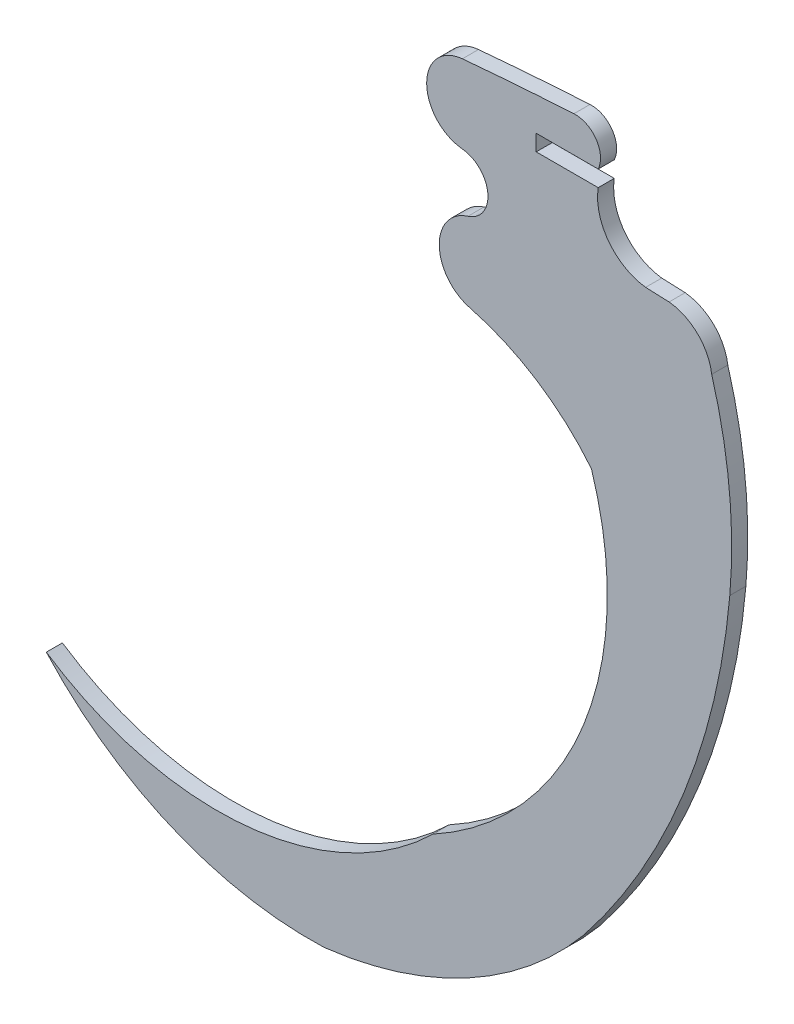
ISO-10303-21;
HEADER;
FILE_DESCRIPTION(('STEP AP214'),'2;1');
FILE_NAME('part.step','',(''),(''),'','','');
FILE_SCHEMA(('AUTOMOTIVE_DESIGN { 1 0 10303 214 1 1 1 1 }'));
ENDSEC;
DATA;
#1=APPLICATION_CONTEXT('core data for automotive mechanical design processes');
#2=APPLICATION_PROTOCOL_DEFINITION('international standard','automotive_design',2000,#1);
#3=PRODUCT_CONTEXT('',#1,'mechanical');
#4=PRODUCT('Part','Part','',(#3));
#5=PRODUCT_RELATED_PRODUCT_CATEGORY('part','',(#4));
#6=PRODUCT_DEFINITION_FORMATION('','',#4);
#7=PRODUCT_DEFINITION_CONTEXT('part definition',#1,'design');
#8=PRODUCT_DEFINITION('design','',#6,#7);
#9=PRODUCT_DEFINITION_SHAPE('','',#8);
#10=(LENGTH_UNIT() NAMED_UNIT(*) SI_UNIT(.MILLI.,.METRE.));
#11=(NAMED_UNIT(*) PLANE_ANGLE_UNIT() SI_UNIT($,.RADIAN.));
#12=(NAMED_UNIT(*) SI_UNIT($,.STERADIAN.) SOLID_ANGLE_UNIT());
#13=UNCERTAINTY_MEASURE_WITH_UNIT(LENGTH_MEASURE(1.E-05),#10,'distance_accuracy_value','');
#14=(GEOMETRIC_REPRESENTATION_CONTEXT(3) GLOBAL_UNCERTAINTY_ASSIGNED_CONTEXT((#13)) GLOBAL_UNIT_ASSIGNED_CONTEXT((#10,
#11,#12)) REPRESENTATION_CONTEXT('',''));
#15=CARTESIAN_POINT('',(0.,0.,0.));
#16=DIRECTION('',(0.,0.,1.));
#17=DIRECTION('',(1.,0.,0.));
#18=AXIS2_PLACEMENT_3D('',#15,#16,#17);
#19=CARTESIAN_POINT('',(-0.784942262282554,20.4143601388889,1.524));
#20=DIRECTION('',(0.,0.,-1.));
#21=DIRECTION('',(-1.,0.,0.));
#22=AXIS2_PLACEMENT_3D('',#19,#20,#21);
#23=CYLINDRICAL_SURFACE('',#22,2.38784541425426);
#24=CARTESIAN_POINT('',(-0.784942262282554,20.4143601388889,0.));
#25=DIRECTION('',(0.,0.,1.));
#26=DIRECTION('',(1.,0.,0.));
#27=AXIS2_PLACEMENT_3D('',#24,#25,#26);
#28=CIRCLE('',#27,2.38784541425426);
#29=CARTESIAN_POINT('',(1.38088964129089,19.4088861770985,0.));
#30=VERTEX_POINT('',#29);
#31=CARTESIAN_POINT('',(-0.921759528206126,22.7982826959617,0.));
#32=VERTEX_POINT('',#31);
#33=EDGE_CURVE('E191',#30,#32,#28,.T.);
#34=ORIENTED_EDGE('',*,*,#33,.T.);
#35=DIRECTION('',(0.,0.,-1.));
#36=VECTOR('',#35,1.);
#37=CARTESIAN_POINT('',(-0.921759528206126,22.7982826959617,1.524));
#38=LINE('',#37,#36);
#39=CARTESIAN_POINT('',(-0.921759528206126,22.7982826959617,1.524));
#40=VERTEX_POINT('',#39);
#41=EDGE_CURVE('E11',#40,#32,#38,.T.);
#42=ORIENTED_EDGE('',*,*,#41,.F.);
#43=CARTESIAN_POINT('',(-0.784942262282554,20.4143601388889,1.524));
#44=DIRECTION('',(0.,0.,1.));
#45=DIRECTION('',(1.,0.,0.));
#46=AXIS2_PLACEMENT_3D('',#43,#44,#45);
#47=CIRCLE('',#46,2.38784541425426);
#48=CARTESIAN_POINT('',(1.38088964129089,19.4088861770985,1.524));
#49=VERTEX_POINT('',#48);
#50=EDGE_CURVE('E225',#49,#40,#47,.T.);
#51=ORIENTED_EDGE('',*,*,#50,.F.);
#52=DIRECTION('',(0.,0.,-1.));
#53=VECTOR('',#52,1.);
#54=CARTESIAN_POINT('',(1.38088964129089,19.4088861770985,1.524));
#55=LINE('',#54,#53);
#56=EDGE_CURVE('E187',#49,#30,#55,.T.);
#57=ORIENTED_EDGE('',*,*,#56,.T.);
#58=EDGE_LOOP('',(#34,#42,#51,#57));
#59=FACE_BOUND('',#58,.T.);
#60=ADVANCED_FACE('F35',(#59),#23,.T.);
#61=CARTESIAN_POINT('',(18.5640747840189,-314.932998519077,1.524));
#62=DIRECTION('',(0.,0.,-1.));
#63=DIRECTION('',(-1.,0.,0.));
#64=AXIS2_PLACEMENT_3D('',#61,#62,#63);
#65=CYLINDRICAL_SURFACE('',#64,338.292944132737);
#66=CARTESIAN_POINT('',(18.5640747840189,-314.932998519077,0.));
#67=DIRECTION('',(0.,0.,1.));
#68=DIRECTION('',(1.,0.,0.));
#69=AXIS2_PLACEMENT_3D('',#66,#67,#68);
#70=CIRCLE('',#69,338.292944132737);
#71=CARTESIAN_POINT('',(-11.4899367335429,22.0222988746534,0.));
#72=VERTEX_POINT('',#71);
#73=EDGE_CURVE('E194',#32,#72,#70,.T.);
#74=ORIENTED_EDGE('',*,*,#73,.T.);
#75=DIRECTION('',(0.,0.,-1.));
#76=VECTOR('',#75,1.);
#77=CARTESIAN_POINT('',(-11.4899367335429,22.0222988746534,1.524));
#78=LINE('',#77,#76);
#79=CARTESIAN_POINT('',(-11.4899367335429,22.0222988746534,1.524));
#80=VERTEX_POINT('',#79);
#81=EDGE_CURVE('E43',#80,#72,#78,.T.);
#82=ORIENTED_EDGE('',*,*,#81,.F.);
#83=CARTESIAN_POINT('',(18.5640747840189,-314.932998519077,1.524));
#84=DIRECTION('',(0.,0.,1.));
#85=DIRECTION('',(1.,0.,0.));
#86=AXIS2_PLACEMENT_3D('',#83,#84,#85);
#87=CIRCLE('',#86,338.292944132737);
#88=EDGE_CURVE('E124',#40,#80,#87,.T.);
#89=ORIENTED_EDGE('',*,*,#88,.F.);
#90=ORIENTED_EDGE('',*,*,#41,.T.);
#91=EDGE_LOOP('',(#74,#82,#89,#90));
#92=FACE_BOUND('',#91,.T.);
#93=ADVANCED_FACE('F333',(#92),#65,.T.);
#94=CARTESIAN_POINT('',(-11.1607671554741,18.3214709585125,1.524));
#95=DIRECTION('',(0.,0.,-1.));
#96=DIRECTION('',(-1.,0.,0.));
#97=AXIS2_PLACEMENT_3D('',#94,#95,#96);
#98=CYLINDRICAL_SURFACE('',#97,3.71543804631613);
#99=CARTESIAN_POINT('',(-11.1607671554741,18.3214709585125,0.));
#100=DIRECTION('',(0.,0.,1.));
#101=DIRECTION('',(1.,0.,0.));
#102=AXIS2_PLACEMENT_3D('',#99,#100,#101);
#103=CIRCLE('',#102,3.71543804631613);
#104=CARTESIAN_POINT('',(-11.509843158306,14.6224676035181,0.));
#105=VERTEX_POINT('',#104);
#106=EDGE_CURVE('E196',#72,#105,#103,.T.);
#107=ORIENTED_EDGE('',*,*,#106,.T.);
#108=DIRECTION('',(0.,0.,-1.));
#109=VECTOR('',#108,1.);
#110=CARTESIAN_POINT('',(-11.509843158306,14.6224676035181,1.524));
#111=LINE('',#110,#109);
#112=CARTESIAN_POINT('',(-11.509843158306,14.6224676035181,1.524));
#113=VERTEX_POINT('',#112);
#114=EDGE_CURVE('E262',#113,#105,#111,.T.);
#115=ORIENTED_EDGE('',*,*,#114,.F.);
#116=CARTESIAN_POINT('',(-11.1607671554741,18.3214709585125,1.524));
#117=DIRECTION('',(0.,0.,1.));
#118=DIRECTION('',(1.,0.,0.));
#119=AXIS2_PLACEMENT_3D('',#116,#117,#118);
#120=CIRCLE('',#119,3.71543804631613);
#121=EDGE_CURVE('E270',#80,#113,#120,.T.);
#122=ORIENTED_EDGE('',*,*,#121,.F.);
#123=ORIENTED_EDGE('',*,*,#81,.T.);
#124=EDGE_LOOP('',(#107,#115,#122,#123));
#125=FACE_BOUND('',#124,.T.);
#126=ADVANCED_FACE('F268',(#125),#98,.T.);
#127=CARTESIAN_POINT('',(-11.7628111813776,11.9378924676735,1.524));
#128=DIRECTION('',(0.,0.,-1.));
#129=DIRECTION('',(-1.,0.,0.));
#130=AXIS2_PLACEMENT_3D('',#127,#128,#129);
#131=CYLINDRICAL_SURFACE('',#130,2.69646740768211);
#132=CARTESIAN_POINT('',(-11.7628111813776,11.9378924676735,0.));
#133=DIRECTION('',(0.,0.,-1.));
#134=DIRECTION('',(1.,0.,0.));
#135=AXIS2_PLACEMENT_3D('',#132,#133,#134);
#136=CIRCLE('',#135,2.69646740768211);
#137=CARTESIAN_POINT('',(-10.9654335967297,9.36201873858796,0.));
#138=VERTEX_POINT('',#137);
#139=EDGE_CURVE('E198',#105,#138,#136,.T.);
#140=ORIENTED_EDGE('',*,*,#139,.T.);
#141=DIRECTION('',(0.,0.,-1.));
#142=VECTOR('',#141,1.);
#143=CARTESIAN_POINT('',(-10.9654335967297,9.36201873858796,1.524));
#144=LINE('',#143,#142);
#145=CARTESIAN_POINT('',(-10.9654335967297,9.36201873858796,1.524));
#146=VERTEX_POINT('',#145);
#147=EDGE_CURVE('E259',#146,#138,#144,.T.);
#148=ORIENTED_EDGE('',*,*,#147,.F.);
#149=CARTESIAN_POINT('',(-11.7628111813776,11.9378924676735,1.524));
#150=DIRECTION('',(0.,0.,-1.));
#151=DIRECTION('',(1.,0.,0.));
#152=AXIS2_PLACEMENT_3D('',#149,#150,#151);
#153=CIRCLE('',#152,2.69646740768211);
#154=EDGE_CURVE('E288',#113,#146,#153,.T.);
#155=ORIENTED_EDGE('',*,*,#154,.F.);
#156=ORIENTED_EDGE('',*,*,#114,.T.);
#157=EDGE_LOOP('',(#140,#148,#155,#156));
#158=FACE_BOUND('',#157,.T.);
#159=ADVANCED_FACE('F279',(#158),#131,.F.);
#160=CARTESIAN_POINT('',(-9.82749523112933,5.67780196556632,1.524));
#161=DIRECTION('',(0.,0.,-1.));
#162=DIRECTION('',(-1.,0.,0.));
#163=AXIS2_PLACEMENT_3D('',#160,#161,#162);
#164=CYLINDRICAL_SURFACE('',#163,3.85595084959847);
#165=CARTESIAN_POINT('',(-9.82749523112933,5.67780196556632,0.));
#166=DIRECTION('',(0.,0.,1.));
#167=DIRECTION('',(1.,0.,0.));
#168=AXIS2_PLACEMENT_3D('',#165,#166,#167);
#169=CIRCLE('',#168,3.85595084959847);
#170=CARTESIAN_POINT('',(-10.8028774320945,1.94725421536135,0.));
#171=VERTEX_POINT('',#170);
#172=EDGE_CURVE('E200',#138,#171,#169,.T.);
#173=ORIENTED_EDGE('',*,*,#172,.T.);
#174=DIRECTION('',(0.,0.,-1.));
#175=VECTOR('',#174,1.);
#176=CARTESIAN_POINT('',(-10.8028774320945,1.94725421536135,1.524));
#177=LINE('',#176,#175);
#178=CARTESIAN_POINT('',(-10.8028774320945,1.94725421536135,1.524));
#179=VERTEX_POINT('',#178);
#180=EDGE_CURVE('E256',#179,#171,#177,.T.);
#181=ORIENTED_EDGE('',*,*,#180,.F.);
#182=CARTESIAN_POINT('',(-9.82749523112933,5.67780196556632,1.524));
#183=DIRECTION('',(0.,0.,1.));
#184=DIRECTION('',(1.,0.,0.));
#185=AXIS2_PLACEMENT_3D('',#182,#183,#184);
#186=CIRCLE('',#185,3.85595084959847);
#187=EDGE_CURVE('E285',#146,#179,#186,.T.);
#188=ORIENTED_EDGE('',*,*,#187,.F.);
#189=ORIENTED_EDGE('',*,*,#147,.T.);
#190=EDGE_LOOP('',(#173,#181,#188,#189));
#191=FACE_BOUND('',#190,.T.);
#192=ADVANCED_FACE('F283',(#191),#164,.T.);
#193=CARTESIAN_POINT('',(-16.3588591186506,-19.3155984191151,1.524));
#194=DIRECTION('',(0.,0.,-1.));
#195=DIRECTION('',(-1.,0.,0.));
#196=AXIS2_PLACEMENT_3D('',#193,#194,#195);
#197=CYLINDRICAL_SURFACE('',#196,21.9767566910318);
#198=CARTESIAN_POINT('',(-16.3588591186506,-19.3155984191151,0.));
#199=DIRECTION('',(0.,0.,-1.));
#200=DIRECTION('',(1.,0.,0.));
#201=AXIS2_PLACEMENT_3D('',#198,#199,#200);
#202=CIRCLE('',#201,21.9767566910318);
#203=CARTESIAN_POINT('',(0.739102642079919,-5.50844308988796,0.));
#204=VERTEX_POINT('',#203);
#205=EDGE_CURVE('E202',#171,#204,#202,.T.);
#206=ORIENTED_EDGE('',*,*,#205,.T.);
#207=DIRECTION('',(0.,0.,-1.));
#208=VECTOR('',#207,1.);
#209=CARTESIAN_POINT('',(0.739102642079919,-5.50844308988796,1.524));
#210=LINE('',#209,#208);
#211=CARTESIAN_POINT('',(0.739102642079919,-5.50844308988796,1.524));
#212=VERTEX_POINT('',#211);
#213=EDGE_CURVE('E253',#212,#204,#210,.T.);
#214=ORIENTED_EDGE('',*,*,#213,.F.);
#215=CARTESIAN_POINT('',(-16.3588591186506,-19.3155984191151,1.524));
#216=DIRECTION('',(0.,0.,-1.));
#217=DIRECTION('',(1.,0.,0.));
#218=AXIS2_PLACEMENT_3D('',#215,#216,#217);
#219=CIRCLE('',#218,21.9767566910318);
#220=EDGE_CURVE('E287',#179,#212,#219,.T.);
#221=ORIENTED_EDGE('',*,*,#220,.F.);
#222=ORIENTED_EDGE('',*,*,#180,.T.);
#223=EDGE_LOOP('',(#206,#214,#221,#222));
#224=FACE_BOUND('',#223,.T.);
#225=ADVANCED_FACE('F346',(#224),#197,.F.);
#226=CARTESIAN_POINT('',(-29.4589149965822,-15.170052695649,1.524));
#227=DIRECTION('',(0.,0.,-1.));
#228=DIRECTION('',(-1.,0.,0.));
#229=AXIS2_PLACEMENT_3D('',#226,#227,#228);
#230=CYLINDRICAL_SURFACE('',#229,31.7059453333138);
#231=CARTESIAN_POINT('',(-29.4589149965822,-15.170052695649,0.));
#232=DIRECTION('',(0.,0.,-1.));
#233=DIRECTION('',(-1.,0.,0.));
#234=AXIS2_PLACEMENT_3D('',#231,#232,#233);
#235=CIRCLE('',#234,31.7059453333138);
#236=CARTESIAN_POINT('',(-14.2759432398881,-43.0042823080257,0.));
#237=VERTEX_POINT('',#236);
#238=EDGE_CURVE('E204',#204,#237,#235,.T.);
#239=ORIENTED_EDGE('',*,*,#238,.T.);
#240=DIRECTION('',(0.,0.,-1.));
#241=VECTOR('',#240,1.);
#242=CARTESIAN_POINT('',(-14.2759432398881,-43.0042823080257,1.524));
#243=LINE('',#242,#241);
#244=CARTESIAN_POINT('',(-14.2759432398881,-43.0042823080257,1.524));
#245=VERTEX_POINT('',#244);
#246=EDGE_CURVE('E250',#245,#237,#243,.T.);
#247=ORIENTED_EDGE('',*,*,#246,.F.);
#248=CARTESIAN_POINT('',(-29.4589149965822,-15.170052695649,1.524));
#249=DIRECTION('',(0.,0.,-1.));
#250=DIRECTION('',(-1.,0.,0.));
#251=AXIS2_PLACEMENT_3D('',#248,#249,#250);
#252=CIRCLE('',#251,31.7059453333138);
#253=EDGE_CURVE('E290',#212,#245,#252,.T.);
#254=ORIENTED_EDGE('',*,*,#253,.F.);
#255=ORIENTED_EDGE('',*,*,#213,.T.);
#256=EDGE_LOOP('',(#239,#247,#254,#255));
#257=FACE_BOUND('',#256,.T.);
#258=ADVANCED_FACE('F349',(#257),#230,.F.);
#259=CARTESIAN_POINT('',(-34.6891920562281,-22.0821229812131,1.524));
#260=DIRECTION('',(0.,0.,-1.));
#261=DIRECTION('',(-1.,0.,0.));
#262=AXIS2_PLACEMENT_3D('',#259,#260,#261);
#263=CYLINDRICAL_SURFACE('',#262,29.2307625308396);
#264=CARTESIAN_POINT('',(-34.6891920562281,-22.0821229812131,0.));
#265=DIRECTION('',(0.,0.,-1.));
#266=DIRECTION('',(-1.,0.,0.));
#267=AXIS2_PLACEMENT_3D('',#264,#265,#266);
#268=CIRCLE('',#267,29.2307625308396);
#269=CARTESIAN_POINT('',(-50.921597014821,-46.3915143227212,0.));
#270=VERTEX_POINT('',#269);
#271=EDGE_CURVE('E206',#237,#270,#268,.T.);
#272=ORIENTED_EDGE('',*,*,#271,.T.);
#273=DIRECTION('',(0.,0.,-1.));
#274=VECTOR('',#273,1.);
#275=CARTESIAN_POINT('',(-50.921597014821,-46.3915143227212,1.524));
#276=LINE('',#275,#274);
#277=CARTESIAN_POINT('',(-50.921597014821,-46.3915143227212,1.524));
#278=VERTEX_POINT('',#277);
#279=EDGE_CURVE('E247',#278,#270,#276,.T.);
#280=ORIENTED_EDGE('',*,*,#279,.F.);
#281=CARTESIAN_POINT('',(-34.6891920562281,-22.0821229812131,1.524));
#282=DIRECTION('',(0.,0.,-1.));
#283=DIRECTION('',(-1.,0.,0.));
#284=AXIS2_PLACEMENT_3D('',#281,#282,#283);
#285=CIRCLE('',#284,29.2307625308396);
#286=EDGE_CURVE('E296',#245,#278,#285,.T.);
#287=ORIENTED_EDGE('',*,*,#286,.F.);
#288=ORIENTED_EDGE('',*,*,#246,.T.);
#289=EDGE_LOOP('',(#272,#280,#287,#288));
#290=FACE_BOUND('',#289,.T.);
#291=ADVANCED_FACE('F353',(#290),#263,.F.);
#292=CARTESIAN_POINT('',(-25.8780555890622,-23.6686254452325,1.524));
#293=DIRECTION('',(0.,0.,-1.));
#294=DIRECTION('',(-1.,0.,0.));
#295=AXIS2_PLACEMENT_3D('',#292,#293,#294);
#296=CYLINDRICAL_SURFACE('',#295,33.815804678913);
#297=CARTESIAN_POINT('',(-25.8780555890622,-23.6686254452325,0.));
#298=DIRECTION('',(0.,0.,1.));
#299=DIRECTION('',(1.,0.,0.));
#300=AXIS2_PLACEMENT_3D('',#297,#298,#299);
#301=CIRCLE('',#300,33.815804678913);
#302=CARTESIAN_POINT('',(-24.5856059006903,-57.4597221999314,0.));
#303=VERTEX_POINT('',#302);
#304=EDGE_CURVE('E208',#270,#303,#301,.T.);
#305=ORIENTED_EDGE('',*,*,#304,.T.);
#306=DIRECTION('',(0.,0.,-1.));
#307=VECTOR('',#306,1.);
#308=CARTESIAN_POINT('',(-24.5856059006903,-57.4597221999314,1.524));
#309=LINE('',#308,#307);
#310=CARTESIAN_POINT('',(-24.5856059006903,-57.4597221999314,1.524));
#311=VERTEX_POINT('',#310);
#312=EDGE_CURVE('E244',#311,#303,#309,.T.);
#313=ORIENTED_EDGE('',*,*,#312,.F.);
#314=CARTESIAN_POINT('',(-25.8780555890622,-23.6686254452325,1.524));
#315=DIRECTION('',(0.,0.,1.));
#316=DIRECTION('',(1.,0.,0.));
#317=AXIS2_PLACEMENT_3D('',#314,#315,#316);
#318=CIRCLE('',#317,33.815804678913);
#319=EDGE_CURVE('E298',#278,#311,#318,.T.);
#320=ORIENTED_EDGE('',*,*,#319,.F.);
#321=ORIENTED_EDGE('',*,*,#279,.T.);
#322=EDGE_LOOP('',(#305,#313,#320,#321));
#323=FACE_BOUND('',#322,.T.);
#324=ADVANCED_FACE('F357',(#323),#296,.T.);
#325=CARTESIAN_POINT('',(-28.904056613606,-20.1084777779075,1.524));
#326=DIRECTION('',(0.,0.,-1.));
#327=DIRECTION('',(-1.,0.,0.));
#328=AXIS2_PLACEMENT_3D('',#325,#326,#327);
#329=CYLINDRICAL_SURFACE('',#328,37.6000595269961);
#330=CARTESIAN_POINT('',(-28.904056613606,-20.1084777779075,0.));
#331=DIRECTION('',(0.,0.,1.));
#332=DIRECTION('',(1.,0.,0.));
#333=AXIS2_PLACEMENT_3D('',#330,#331,#332);
#334=CIRCLE('',#333,37.6000595269961);
#335=CARTESIAN_POINT('',(0.,-44.1567622845227,0.));
#336=VERTEX_POINT('',#335);
#337=EDGE_CURVE('E210',#303,#336,#334,.T.);
#338=ORIENTED_EDGE('',*,*,#337,.T.);
#339=DIRECTION('',(0.,0.,-1.));
#340=VECTOR('',#339,1.);
#341=CARTESIAN_POINT('',(0.,-44.1567622845227,1.524));
#342=LINE('',#341,#340);
#343=CARTESIAN_POINT('',(0.,-44.1567622845227,1.524));
#344=VERTEX_POINT('',#343);
#345=EDGE_CURVE('E241',#344,#336,#342,.T.);
#346=ORIENTED_EDGE('',*,*,#345,.F.);
#347=CARTESIAN_POINT('',(-28.904056613606,-20.1084777779075,1.524));
#348=DIRECTION('',(0.,0.,1.));
#349=DIRECTION('',(1.,0.,0.));
#350=AXIS2_PLACEMENT_3D('',#347,#348,#349);
#351=CIRCLE('',#350,37.6000595269961);
#352=EDGE_CURVE('E300',#311,#344,#351,.T.);
#353=ORIENTED_EDGE('',*,*,#352,.F.);
#354=ORIENTED_EDGE('',*,*,#312,.T.);
#355=EDGE_LOOP('',(#338,#346,#353,#354));
#356=FACE_BOUND('',#355,.T.);
#357=ADVANCED_FACE('F361',(#356),#329,.T.);
#358=CARTESIAN_POINT('',(-51.0452631563205,-3.67881608137278,1.524));
#359=DIRECTION('',(0.,0.,-1.));
#360=DIRECTION('',(-1.,0.,0.));
#361=AXIS2_PLACEMENT_3D('',#358,#359,#360);
#362=CYLINDRICAL_SURFACE('',#361,65.1466270771028);
#363=CARTESIAN_POINT('',(-51.0452631563205,-3.67881608137278,0.));
#364=DIRECTION('',(0.,0.,1.));
#365=DIRECTION('',(-1.,0.,0.));
#366=AXIS2_PLACEMENT_3D('',#363,#364,#365);
#367=CIRCLE('',#366,65.1466270771028);
#368=CARTESIAN_POINT('',(13.8535936008203,-9.35520676024911,0.));
#369=VERTEX_POINT('',#368);
#370=EDGE_CURVE('E212',#336,#369,#367,.T.);
#371=ORIENTED_EDGE('',*,*,#370,.T.);
#372=DIRECTION('',(0.,0.,-1.));
#373=VECTOR('',#372,1.);
#374=CARTESIAN_POINT('',(13.8535936008203,-9.35520676024911,1.524));
#375=LINE('',#374,#373);
#376=CARTESIAN_POINT('',(13.8535936008203,-9.35520676024911,1.524));
#377=VERTEX_POINT('',#376);
#378=EDGE_CURVE('E238',#377,#369,#375,.T.);
#379=ORIENTED_EDGE('',*,*,#378,.F.);
#380=CARTESIAN_POINT('',(-51.0452631563205,-3.67881608137278,1.524));
#381=DIRECTION('',(0.,0.,1.));
#382=DIRECTION('',(-1.,0.,0.));
#383=AXIS2_PLACEMENT_3D('',#380,#381,#382);
#384=CIRCLE('',#383,65.1466270771028);
#385=EDGE_CURVE('E302',#344,#377,#384,.T.);
#386=ORIENTED_EDGE('',*,*,#385,.F.);
#387=ORIENTED_EDGE('',*,*,#345,.T.);
#388=EDGE_LOOP('',(#371,#379,#386,#387));
#389=FACE_BOUND('',#388,.T.);
#390=ADVANCED_FACE('F365',(#389),#362,.T.);
#391=CARTESIAN_POINT('',(-32.9399116034648,-5.26240405083409,1.524));
#392=DIRECTION('',(0.,0.,-1.));
#393=DIRECTION('',(-1.,0.,0.));
#394=AXIS2_PLACEMENT_3D('',#391,#392,#393);
#395=CYLINDRICAL_SURFACE('',#394,46.9721530624439);
#396=CARTESIAN_POINT('',(-32.9399116034648,-5.26240405083409,0.));
#397=DIRECTION('',(0.,0.,1.));
#398=DIRECTION('',(1.,0.,0.));
#399=AXIS2_PLACEMENT_3D('',#396,#397,#398);
#400=CIRCLE('',#399,46.9721530624439);
#401=CARTESIAN_POINT('',(12.1391201751654,7.93850717615695,0.));
#402=VERTEX_POINT('',#401);
#403=EDGE_CURVE('E214',#369,#402,#400,.T.);
#404=ORIENTED_EDGE('',*,*,#403,.T.);
#405=DIRECTION('',(0.,0.,-1.));
#406=VECTOR('',#405,1.);
#407=CARTESIAN_POINT('',(12.1391201751654,7.93850717615695,1.524));
#408=LINE('',#407,#406);
#409=CARTESIAN_POINT('',(12.1391201751654,7.93850717615695,1.524));
#410=VERTEX_POINT('',#409);
#411=EDGE_CURVE('E235',#410,#402,#408,.T.);
#412=ORIENTED_EDGE('',*,*,#411,.F.);
#413=CARTESIAN_POINT('',(-32.9399116034648,-5.26240405083409,1.524));
#414=DIRECTION('',(0.,0.,1.));
#415=DIRECTION('',(1.,0.,0.));
#416=AXIS2_PLACEMENT_3D('',#413,#414,#415);
#417=CIRCLE('',#416,46.9721530624439);
#418=EDGE_CURVE('E304',#377,#410,#417,.T.);
#419=ORIENTED_EDGE('',*,*,#418,.F.);
#420=ORIENTED_EDGE('',*,*,#378,.T.);
#421=EDGE_LOOP('',(#404,#412,#419,#420));
#422=FACE_BOUND('',#421,.T.);
#423=ADVANCED_FACE('F369',(#422),#395,.T.);
#424=CARTESIAN_POINT('',(7.63760947517506,7.34236363399599,1.524));
#425=DIRECTION('',(0.,0.,-1.));
#426=DIRECTION('',(-1.,0.,0.));
#427=AXIS2_PLACEMENT_3D('',#424,#425,#426);
#428=CYLINDRICAL_SURFACE('',#427,4.54081333077987);
#429=CARTESIAN_POINT('',(7.63760947517506,7.34236363399599,0.));
#430=DIRECTION('',(0.,0.,1.));
#431=DIRECTION('',(1.,0.,0.));
#432=AXIS2_PLACEMENT_3D('',#429,#430,#431);
#433=CIRCLE('',#432,4.54081333077987);
#434=CARTESIAN_POINT('',(8.09848371158894,11.8597279809574,0.));
#435=VERTEX_POINT('',#434);
#436=EDGE_CURVE('E216',#402,#435,#433,.T.);
#437=ORIENTED_EDGE('',*,*,#436,.T.);
#438=DIRECTION('',(0.,0.,-1.));
#439=VECTOR('',#438,1.);
#440=CARTESIAN_POINT('',(8.09848371158894,11.8597279809574,1.524));
#441=LINE('',#440,#439);
#442=CARTESIAN_POINT('',(8.09848371158894,11.8597279809574,1.524));
#443=VERTEX_POINT('',#442);
#444=EDGE_CURVE('E232',#443,#435,#441,.T.);
#445=ORIENTED_EDGE('',*,*,#444,.F.);
#446=CARTESIAN_POINT('',(7.63760947517506,7.34236363399599,1.524));
#447=DIRECTION('',(0.,0.,1.));
#448=DIRECTION('',(1.,0.,0.));
#449=AXIS2_PLACEMENT_3D('',#446,#447,#448);
#450=CIRCLE('',#449,4.54081333077987);
#451=EDGE_CURVE('E306',#410,#443,#450,.T.);
#452=ORIENTED_EDGE('',*,*,#451,.F.);
#453=ORIENTED_EDGE('',*,*,#411,.T.);
#454=EDGE_LOOP('',(#437,#445,#452,#453));
#455=FACE_BOUND('',#454,.T.);
#456=ADVANCED_FACE('F373',(#455),#428,.T.);
#457=CARTESIAN_POINT('',(8.09848371158894,11.8597279809574,1.524));
#458=DIRECTION('',(-0.0405453524999934,-0.999177699105945,0.));
#459=DIRECTION('',(0.999177699105946,-0.0405453524999934,0.));
#460=AXIS2_PLACEMENT_3D('',#457,#458,#459);
#461=PLANE('',#460);
#462=DIRECTION('',(-0.999177699105945,0.0405453524999934,0.));
#463=VECTOR('',#462,1.);
#464=CARTESIAN_POINT('',(8.09848371158894,11.8597279809574,0.));
#465=LINE('',#464,#463);
#466=CARTESIAN_POINT('',(5.87736771760888,11.9498580258932,0.));
#467=VERTEX_POINT('',#466);
#468=EDGE_CURVE('E218',#435,#467,#465,.T.);
#469=ORIENTED_EDGE('',*,*,#468,.T.);
#470=DIRECTION('',(0.,0.,-1.));
#471=VECTOR('',#470,1.);
#472=CARTESIAN_POINT('',(5.87736771760888,11.9498580258932,1.524));
#473=LINE('',#472,#471);
#474=CARTESIAN_POINT('',(5.87736771760888,11.9498580258932,1.524));
#475=VERTEX_POINT('',#474);
#476=EDGE_CURVE('E229',#475,#467,#473,.T.);
#477=ORIENTED_EDGE('',*,*,#476,.F.);
#478=DIRECTION('',(-0.999177699105945,0.0405453524999934,0.));
#479=VECTOR('',#478,1.);
#480=CARTESIAN_POINT('',(8.09848371158894,11.8597279809574,1.524));
#481=LINE('',#480,#479);
#482=EDGE_CURVE('E308',#443,#475,#481,.T.);
#483=ORIENTED_EDGE('',*,*,#482,.F.);
#484=ORIENTED_EDGE('',*,*,#444,.T.);
#485=EDGE_LOOP('',(#469,#477,#483,#484));
#486=FACE_BOUND('',#485,.T.);
#487=ADVANCED_FACE('F314',(#486),#461,.F.);
#488=CARTESIAN_POINT('',(6.49742773391468,17.0919251041141,1.524));
#489=DIRECTION('',(0.,0.,-1.));
#490=DIRECTION('',(-1.,0.,0.));
#491=AXIS2_PLACEMENT_3D('',#488,#489,#490);
#492=CYLINDRICAL_SURFACE('',#491,5.17931735470457);
#493=CARTESIAN_POINT('',(6.49742773391468,17.0919251041141,0.));
#494=DIRECTION('',(0.,0.,-1.));
#495=DIRECTION('',(1.,0.,0.));
#496=AXIS2_PLACEMENT_3D('',#493,#494,#495);
#497=CIRCLE('',#496,5.17931735470457);
#498=CARTESIAN_POINT('',(1.37883872255957,17.8827315239026,0.));
#499=VERTEX_POINT('',#498);
#500=EDGE_CURVE('E220',#467,#499,#497,.T.);
#501=ORIENTED_EDGE('',*,*,#500,.T.);
#502=DIRECTION('',(0.,0.,-1.));
#503=VECTOR('',#502,1.);
#504=CARTESIAN_POINT('',(1.37883872255957,17.8827315239026,1.524));
#505=LINE('',#504,#503);
#506=CARTESIAN_POINT('',(1.37883872255957,17.8827315239026,1.524));
#507=VERTEX_POINT('',#506);
#508=EDGE_CURVE('E182',#507,#499,#505,.T.);
#509=ORIENTED_EDGE('',*,*,#508,.F.);
#510=CARTESIAN_POINT('',(6.49742773391468,17.0919251041141,1.524));
#511=DIRECTION('',(0.,0.,-1.));
#512=DIRECTION('',(1.,0.,0.));
#513=AXIS2_PLACEMENT_3D('',#510,#511,#512);
#514=CIRCLE('',#513,5.17931735470457);
#515=EDGE_CURVE('E173',#475,#507,#514,.T.);
#516=ORIENTED_EDGE('',*,*,#515,.F.);
#517=ORIENTED_EDGE('',*,*,#476,.T.);
#518=EDGE_LOOP('',(#501,#509,#516,#517));
#519=FACE_BOUND('',#518,.T.);
#520=ADVANCED_FACE('F318',(#519),#492,.F.);
#521=CARTESIAN_POINT('',(1.37883872255957,17.8827315239026,1.524));
#522=DIRECTION('',(0.000139606381703428,-0.999999990255029,0.));
#523=DIRECTION('',(0.999999990255029,0.000139606381703428,0.));
#524=AXIS2_PLACEMENT_3D('',#521,#522,#523);
#525=PLANE('',#524);
#526=DIRECTION('',(-0.999999990255029,-0.000139606381703428,0.));
#527=VECTOR('',#526,1.);
#528=CARTESIAN_POINT('',(1.37883872255957,17.8827315239026,0.));
#529=LINE('',#528,#527);
#530=CARTESIAN_POINT('',(-4.4945357511411,17.881911563336,0.));
#531=VERTEX_POINT('',#530);
#532=EDGE_CURVE('E181',#499,#531,#529,.T.);
#533=ORIENTED_EDGE('',*,*,#532,.T.);
#534=DIRECTION('',(0.,0.,-1.));
#535=VECTOR('',#534,1.);
#536=CARTESIAN_POINT('',(-4.4945357511411,17.881911563336,1.524));
#537=LINE('',#536,#535);
#538=CARTESIAN_POINT('',(-4.4945357511411,17.881911563336,1.524));
#539=VERTEX_POINT('',#538);
#540=EDGE_CURVE('E178',#539,#531,#537,.T.);
#541=ORIENTED_EDGE('',*,*,#540,.F.);
#542=DIRECTION('',(-0.999999990255029,-0.000139606381703428,0.));
#543=VECTOR('',#542,1.);
#544=CARTESIAN_POINT('',(1.37883872255957,17.8827315239026,1.524));
#545=LINE('',#544,#543);
#546=EDGE_CURVE('E167',#507,#539,#545,.T.);
#547=ORIENTED_EDGE('',*,*,#546,.F.);
#548=ORIENTED_EDGE('',*,*,#508,.T.);
#549=EDGE_LOOP('',(#533,#541,#547,#548));
#550=FACE_BOUND('',#549,.T.);
#551=ADVANCED_FACE('F179',(#550),#525,.F.);
#552=CARTESIAN_POINT('',(-4.4945357511411,17.881911563336,1.524));
#553=DIRECTION('',(-1.,0.,0.));
#554=DIRECTION('',(0.,0.,1.));
#555=AXIS2_PLACEMENT_3D('',#552,#553,#554);
#556=PLANE('',#555);
#557=DIRECTION('',(0.,1.,0.));
#558=VECTOR('',#557,1.);
#559=CARTESIAN_POINT('',(-4.4945357511411,17.881911563336,0.));
#560=LINE('',#559,#558);
#561=CARTESIAN_POINT('',(-4.4945357511411,19.4088861770985,0.));
#562=VERTEX_POINT('',#561);
#563=EDGE_CURVE('E110',#531,#562,#560,.T.);
#564=ORIENTED_EDGE('',*,*,#563,.T.);
#565=DIRECTION('',(0.,0.,-1.));
#566=VECTOR('',#565,1.);
#567=CARTESIAN_POINT('',(-4.4945357511411,19.4088861770985,1.524));
#568=LINE('',#567,#566);
#569=CARTESIAN_POINT('',(-4.4945357511411,19.4088861770985,1.524));
#570=VERTEX_POINT('',#569);
#571=EDGE_CURVE('E183',#570,#562,#568,.T.);
#572=ORIENTED_EDGE('',*,*,#571,.F.);
#573=DIRECTION('',(0.,1.,0.));
#574=VECTOR('',#573,1.);
#575=CARTESIAN_POINT('',(-4.4945357511411,17.881911563336,1.524));
#576=LINE('',#575,#574);
#577=EDGE_CURVE('E171',#539,#570,#576,.T.);
#578=ORIENTED_EDGE('',*,*,#577,.F.);
#579=ORIENTED_EDGE('',*,*,#540,.T.);
#580=EDGE_LOOP('',(#564,#572,#578,#579));
#581=FACE_BOUND('',#580,.T.);
#582=ADVANCED_FACE('F185',(#581),#556,.F.);
#583=CARTESIAN_POINT('',(-4.4945357511411,19.4088861770985,1.524));
#584=DIRECTION('',(0.,1.,0.));
#585=DIRECTION('',(0.,0.,1.));
#586=AXIS2_PLACEMENT_3D('',#583,#584,#585);
#587=PLANE('',#586);
#588=DIRECTION('',(1.,0.,0.));
#589=VECTOR('',#588,1.);
#590=CARTESIAN_POINT('',(-4.4945357511411,19.4088861770985,0.));
#591=LINE('',#590,#589);
#592=EDGE_CURVE('E116',#562,#30,#591,.T.);
#593=ORIENTED_EDGE('',*,*,#592,.T.);
#594=ORIENTED_EDGE('',*,*,#56,.F.);
#595=DIRECTION('',(1.,0.,0.));
#596=VECTOR('',#595,1.);
#597=CARTESIAN_POINT('',(-4.4945357511411,19.4088861770985,1.524));
#598=LINE('',#597,#596);
#599=EDGE_CURVE('E51',#570,#49,#598,.T.);
#600=ORIENTED_EDGE('',*,*,#599,.F.);
#601=ORIENTED_EDGE('',*,*,#571,.T.);
#602=EDGE_LOOP('',(#593,#594,#600,#601));
#603=FACE_BOUND('',#602,.T.);
#604=ADVANCED_FACE('F322',(#603),#587,.F.);
#605=CARTESIAN_POINT('',(-0.784942262282554,20.4143601388889,1.524));
#606=DIRECTION('',(0.,0.,1.));
#607=DIRECTION('',(1.,0.,0.));
#608=AXIS2_PLACEMENT_3D('',#605,#606,#607);
#609=PLANE('',#608);
#610=ORIENTED_EDGE('',*,*,#50,.T.);
#611=ORIENTED_EDGE('',*,*,#88,.T.);
#612=ORIENTED_EDGE('',*,*,#121,.T.);
#613=ORIENTED_EDGE('',*,*,#154,.T.);
#614=ORIENTED_EDGE('',*,*,#187,.T.);
#615=ORIENTED_EDGE('',*,*,#220,.T.);
#616=ORIENTED_EDGE('',*,*,#253,.T.);
#617=ORIENTED_EDGE('',*,*,#286,.T.);
#618=ORIENTED_EDGE('',*,*,#319,.T.);
#619=ORIENTED_EDGE('',*,*,#352,.T.);
#620=ORIENTED_EDGE('',*,*,#385,.T.);
#621=ORIENTED_EDGE('',*,*,#418,.T.);
#622=ORIENTED_EDGE('',*,*,#451,.T.);
#623=ORIENTED_EDGE('',*,*,#482,.T.);
#624=ORIENTED_EDGE('',*,*,#515,.T.);
#625=ORIENTED_EDGE('',*,*,#546,.T.);
#626=ORIENTED_EDGE('',*,*,#577,.T.);
#627=ORIENTED_EDGE('',*,*,#599,.T.);
#628=EDGE_LOOP('',(#610,#611,#612,#613,#614,#615,#616,#617,#618,#619,#620,#621,#622,#623,#624,
#625,#626,#627));
#629=FACE_BOUND('',#628,.T.);
#630=ADVANCED_FACE('F169',(#629),#609,.T.);
#631=CARTESIAN_POINT('',(-0.784942262282554,20.4143601388889,0.));
#632=DIRECTION('',(0.,0.,1.));
#633=DIRECTION('',(1.,0.,0.));
#634=AXIS2_PLACEMENT_3D('',#631,#632,#633);
#635=PLANE('',#634);
#636=ORIENTED_EDGE('',*,*,#33,.F.);
#637=ORIENTED_EDGE('',*,*,#592,.F.);
#638=ORIENTED_EDGE('',*,*,#563,.F.);
#639=ORIENTED_EDGE('',*,*,#532,.F.);
#640=ORIENTED_EDGE('',*,*,#500,.F.);
#641=ORIENTED_EDGE('',*,*,#468,.F.);
#642=ORIENTED_EDGE('',*,*,#436,.F.);
#643=ORIENTED_EDGE('',*,*,#403,.F.);
#644=ORIENTED_EDGE('',*,*,#370,.F.);
#645=ORIENTED_EDGE('',*,*,#337,.F.);
#646=ORIENTED_EDGE('',*,*,#304,.F.);
#647=ORIENTED_EDGE('',*,*,#271,.F.);
#648=ORIENTED_EDGE('',*,*,#238,.F.);
#649=ORIENTED_EDGE('',*,*,#205,.F.);
#650=ORIENTED_EDGE('',*,*,#172,.F.);
#651=ORIENTED_EDGE('',*,*,#139,.F.);
#652=ORIENTED_EDGE('',*,*,#106,.F.);
#653=ORIENTED_EDGE('',*,*,#73,.F.);
#654=EDGE_LOOP('',(#636,#637,#638,#639,#640,#641,#642,#643,#644,#645,#646,#647,#648,#649,#650,
#651,#652,#653));
#655=FACE_BOUND('',#654,.T.);
#656=ADVANCED_FACE('F274',(#655),#635,.F.);
#657=CLOSED_SHELL('',(#60,#93,#126,#159,#192,#225,#258,#291,#324,#357,#390,#423,#456,#487,#520,
#551,#582,#604,#630,#656));
#658=MANIFOLD_SOLID_BREP('B2',#657);
#659=ADVANCED_BREP_SHAPE_REPRESENTATION('',(#18,#658),#14);
#660=SHAPE_DEFINITION_REPRESENTATION(#9,#659);
ENDSEC;
END-ISO-10303-21;
